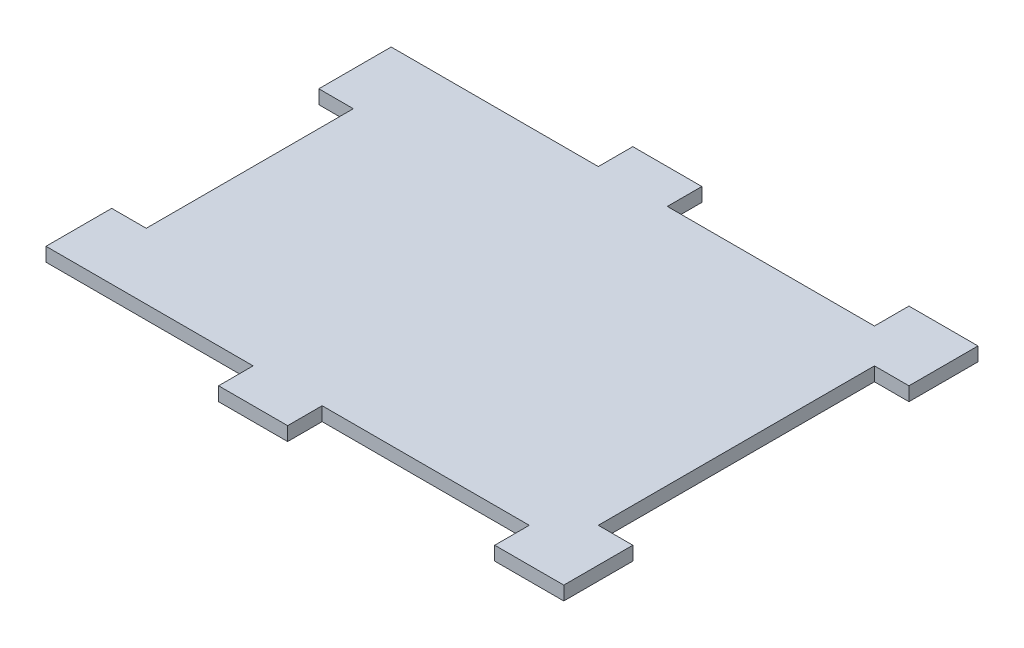
ISO-10303-21;
HEADER;
FILE_DESCRIPTION(('STEP AP214'),'2;1');
FILE_NAME('part.step','',(''),(''),'','','');
FILE_SCHEMA(('AUTOMOTIVE_DESIGN { 1 0 10303 214 1 1 1 1 }'));
ENDSEC;
DATA;
#1=APPLICATION_CONTEXT('core data for automotive mechanical design processes');
#2=APPLICATION_PROTOCOL_DEFINITION('international standard','automotive_design',2000,#1);
#3=PRODUCT_CONTEXT('',#1,'mechanical');
#4=PRODUCT('Part','Part','',(#3));
#5=PRODUCT_RELATED_PRODUCT_CATEGORY('part','',(#4));
#6=PRODUCT_DEFINITION_FORMATION('','',#4);
#7=PRODUCT_DEFINITION_CONTEXT('part definition',#1,'design');
#8=PRODUCT_DEFINITION('design','',#6,#7);
#9=PRODUCT_DEFINITION_SHAPE('','',#8);
#10=(LENGTH_UNIT() NAMED_UNIT(*) SI_UNIT(.MILLI.,.METRE.));
#11=(NAMED_UNIT(*) PLANE_ANGLE_UNIT() SI_UNIT($,.RADIAN.));
#12=(NAMED_UNIT(*) SI_UNIT($,.STERADIAN.) SOLID_ANGLE_UNIT());
#13=UNCERTAINTY_MEASURE_WITH_UNIT(LENGTH_MEASURE(1.E-05),#10,'distance_accuracy_value','');
#14=(GEOMETRIC_REPRESENTATION_CONTEXT(3) GLOBAL_UNCERTAINTY_ASSIGNED_CONTEXT((#13)) GLOBAL_UNIT_ASSIGNED_CONTEXT((#10,
#11,#12)) REPRESENTATION_CONTEXT('',''));
#15=CARTESIAN_POINT('',(0.,0.,0.));
#16=DIRECTION('',(0.,0.,1.));
#17=DIRECTION('',(1.,0.,0.));
#18=AXIS2_PLACEMENT_3D('',#15,#16,#17);
#19=CARTESIAN_POINT('',(27.885513147577,-380.101338205117,0.));
#20=DIRECTION('',(1.,0.,0.));
#21=DIRECTION('',(0.,0.,-1.));
#22=AXIS2_PLACEMENT_3D('',#19,#20,#21);
#23=PLANE('',#22);
#24=DIRECTION('',(0.,0.,1.));
#25=VECTOR('',#24,1.);
#26=CARTESIAN_POINT('',(27.885513147577,-382.641338205117,0.));
#27=LINE('',#26,#25);
#28=CARTESIAN_POINT('',(27.8855131475768,-382.641338205117,117.064580044582));
#29=VERTEX_POINT('',#28);
#30=CARTESIAN_POINT('',(27.8855131475768,-382.641338205117,123.414580044582));
#31=VERTEX_POINT('',#30);
#32=EDGE_CURVE('E226',#29,#31,#27,.T.);
#33=ORIENTED_EDGE('',*,*,#32,.F.);
#34=DIRECTION('',(0.,-1.,0.));
#35=VECTOR('',#34,1.);
#36=CARTESIAN_POINT('',(27.8855131475768,-380.101338205117,117.064580044582));
#37=LINE('',#36,#35);
#38=CARTESIAN_POINT('',(27.8855131475768,-380.101338205117,117.064580044582));
#39=VERTEX_POINT('',#38);
#40=EDGE_CURVE('E11',#39,#29,#37,.T.);
#41=ORIENTED_EDGE('',*,*,#40,.F.);
#42=DIRECTION('',(0.,0.,1.));
#43=VECTOR('',#42,1.);
#44=CARTESIAN_POINT('',(27.885513147577,-380.101338205117,0.));
#45=LINE('',#44,#43);
#46=CARTESIAN_POINT('',(27.8855131475768,-380.101338205117,123.414580044582));
#47=VERTEX_POINT('',#46);
#48=EDGE_CURVE('E290',#39,#47,#45,.T.);
#49=ORIENTED_EDGE('',*,*,#48,.T.);
#50=DIRECTION('',(0.,-1.,0.));
#51=VECTOR('',#50,1.);
#52=CARTESIAN_POINT('',(27.8855131475768,-380.101338205117,123.414580044582));
#53=LINE('',#52,#51);
#54=EDGE_CURVE('E135',#47,#31,#53,.T.);
#55=ORIENTED_EDGE('',*,*,#54,.T.);
#56=EDGE_LOOP('',(#33,#41,#49,#55));
#57=FACE_BOUND('',#56,.T.);
#58=ADVANCED_FACE('F37',(#57),#23,.T.);
#59=CARTESIAN_POINT('',(0.,-380.101338205117,117.064580044582));
#60=DIRECTION('',(0.,0.,1.));
#61=DIRECTION('',(1.,0.,0.));
#62=AXIS2_PLACEMENT_3D('',#59,#60,#61);
#63=PLANE('',#62);
#64=DIRECTION('',(-1.,0.,0.));
#65=VECTOR('',#64,1.);
#66=CARTESIAN_POINT('',(0.,-382.641338205117,117.064580044582));
#67=LINE('',#66,#65);
#68=CARTESIAN_POINT('',(65.9855131475768,-382.641338205117,117.064580044582));
#69=VERTEX_POINT('',#68);
#70=EDGE_CURVE('E229',#69,#29,#67,.T.);
#71=ORIENTED_EDGE('',*,*,#70,.F.);
#72=DIRECTION('',(0.,-1.,0.));
#73=VECTOR('',#72,1.);
#74=CARTESIAN_POINT('',(65.9855131475768,-380.101338205117,117.064580044582));
#75=LINE('',#74,#73);
#76=CARTESIAN_POINT('',(65.9855131475768,-380.101338205117,117.064580044582));
#77=VERTEX_POINT('',#76);
#78=EDGE_CURVE('E45',#77,#69,#75,.T.);
#79=ORIENTED_EDGE('',*,*,#78,.F.);
#80=DIRECTION('',(-1.,0.,0.));
#81=VECTOR('',#80,1.);
#82=CARTESIAN_POINT('',(0.,-380.101338205117,117.064580044582));
#83=LINE('',#82,#81);
#84=EDGE_CURVE('E428',#77,#39,#83,.T.);
#85=ORIENTED_EDGE('',*,*,#84,.T.);
#86=ORIENTED_EDGE('',*,*,#40,.T.);
#87=EDGE_LOOP('',(#71,#79,#85,#86));
#88=FACE_BOUND('',#87,.T.);
#89=ADVANCED_FACE('F342',(#88),#63,.T.);
#90=CARTESIAN_POINT('',(65.9855131475768,-380.101338205117,0.));
#91=DIRECTION('',(-1.,0.,0.));
#92=DIRECTION('',(0.,0.,1.));
#93=AXIS2_PLACEMENT_3D('',#90,#91,#92);
#94=PLANE('',#93);
#95=DIRECTION('',(0.,0.,-1.));
#96=VECTOR('',#95,1.);
#97=CARTESIAN_POINT('',(65.9855131475768,-382.641338205117,0.));
#98=LINE('',#97,#96);
#99=CARTESIAN_POINT('',(65.9855131475768,-382.641338205117,123.414580044582));
#100=VERTEX_POINT('',#99);
#101=EDGE_CURVE('E232',#100,#69,#98,.T.);
#102=ORIENTED_EDGE('',*,*,#101,.F.);
#103=DIRECTION('',(0.,-1.,0.));
#104=VECTOR('',#103,1.);
#105=CARTESIAN_POINT('',(65.9855131475768,-380.101338205117,123.414580044582));
#106=LINE('',#105,#104);
#107=CARTESIAN_POINT('',(65.9855131475768,-380.101338205117,123.414580044582));
#108=VERTEX_POINT('',#107);
#109=EDGE_CURVE('E331',#108,#100,#106,.T.);
#110=ORIENTED_EDGE('',*,*,#109,.F.);
#111=DIRECTION('',(0.,0.,-1.));
#112=VECTOR('',#111,1.);
#113=CARTESIAN_POINT('',(65.9855131475768,-380.101338205117,0.));
#114=LINE('',#113,#112);
#115=EDGE_CURVE('E338',#108,#77,#114,.T.);
#116=ORIENTED_EDGE('',*,*,#115,.T.);
#117=ORIENTED_EDGE('',*,*,#78,.T.);
#118=EDGE_LOOP('',(#102,#110,#116,#117));
#119=FACE_BOUND('',#118,.T.);
#120=ADVANCED_FACE('F336',(#119),#94,.T.);
#121=CARTESIAN_POINT('',(0.,-380.101338205117,123.414580044582));
#122=DIRECTION('',(0.,0.,-1.));
#123=DIRECTION('',(-1.,0.,0.));
#124=AXIS2_PLACEMENT_3D('',#121,#122,#123);
#125=PLANE('',#124);
#126=DIRECTION('',(1.,0.,0.));
#127=VECTOR('',#126,1.);
#128=CARTESIAN_POINT('',(0.,-382.641338205117,123.414580044582));
#129=LINE('',#128,#127);
#130=CARTESIAN_POINT('',(78.6855131475768,-382.641338205117,123.414580044582));
#131=VERTEX_POINT('',#130);
#132=EDGE_CURVE('E235',#100,#131,#129,.T.);
#133=ORIENTED_EDGE('',*,*,#132,.T.);
#134=DIRECTION('',(0.,-1.,0.));
#135=VECTOR('',#134,1.);
#136=CARTESIAN_POINT('',(78.6855131475768,-380.101338205117,123.414580044582));
#137=LINE('',#136,#135);
#138=CARTESIAN_POINT('',(78.6855131475768,-380.101338205117,123.414580044582));
#139=VERTEX_POINT('',#138);
#140=EDGE_CURVE('E328',#139,#131,#137,.T.);
#141=ORIENTED_EDGE('',*,*,#140,.F.);
#142=DIRECTION('',(1.,0.,0.));
#143=VECTOR('',#142,1.);
#144=CARTESIAN_POINT('',(0.,-380.101338205117,123.414580044582));
#145=LINE('',#144,#143);
#146=EDGE_CURVE('E359',#108,#139,#145,.T.);
#147=ORIENTED_EDGE('',*,*,#146,.F.);
#148=ORIENTED_EDGE('',*,*,#109,.T.);
#149=EDGE_LOOP('',(#133,#141,#147,#148));
#150=FACE_BOUND('',#149,.T.);
#151=ADVANCED_FACE('F349',(#150),#125,.F.);
#152=CARTESIAN_POINT('',(78.6855131475768,-380.101338205117,0.));
#153=DIRECTION('',(-1.,0.,0.));
#154=DIRECTION('',(0.,0.,1.));
#155=AXIS2_PLACEMENT_3D('',#152,#153,#154);
#156=PLANE('',#155);
#157=DIRECTION('',(0.,0.,-1.));
#158=VECTOR('',#157,1.);
#159=CARTESIAN_POINT('',(78.6855131475768,-382.641338205117,0.));
#160=LINE('',#159,#158);
#161=CARTESIAN_POINT('',(78.6855131475768,-382.641338205117,110.714580044582));
#162=VERTEX_POINT('',#161);
#163=EDGE_CURVE('E237',#131,#162,#160,.T.);
#164=ORIENTED_EDGE('',*,*,#163,.T.);
#165=DIRECTION('',(0.,-1.,0.));
#166=VECTOR('',#165,1.);
#167=CARTESIAN_POINT('',(78.6855131475768,-380.101338205117,110.714580044582));
#168=LINE('',#167,#166);
#169=CARTESIAN_POINT('',(78.6855131475768,-380.101338205117,110.714580044582));
#170=VERTEX_POINT('',#169);
#171=EDGE_CURVE('E326',#170,#162,#168,.T.);
#172=ORIENTED_EDGE('',*,*,#171,.F.);
#173=DIRECTION('',(0.,0.,-1.));
#174=VECTOR('',#173,1.);
#175=CARTESIAN_POINT('',(78.6855131475768,-380.101338205117,0.));
#176=LINE('',#175,#174);
#177=EDGE_CURVE('E355',#139,#170,#176,.T.);
#178=ORIENTED_EDGE('',*,*,#177,.F.);
#179=ORIENTED_EDGE('',*,*,#140,.T.);
#180=EDGE_LOOP('',(#164,#172,#178,#179));
#181=FACE_BOUND('',#180,.T.);
#182=ADVANCED_FACE('F353',(#181),#156,.F.);
#183=CARTESIAN_POINT('',(0.,-380.101338205117,110.714580044582));
#184=DIRECTION('',(0.,0.,-1.));
#185=DIRECTION('',(-1.,0.,0.));
#186=AXIS2_PLACEMENT_3D('',#183,#184,#185);
#187=PLANE('',#186);
#188=DIRECTION('',(1.,0.,0.));
#189=VECTOR('',#188,1.);
#190=CARTESIAN_POINT('',(0.,-382.641338205117,110.714580044582));
#191=LINE('',#190,#189);
#192=CARTESIAN_POINT('',(72.3355131475768,-382.641338205117,110.714580044582));
#193=VERTEX_POINT('',#192);
#194=EDGE_CURVE('E240',#193,#162,#191,.T.);
#195=ORIENTED_EDGE('',*,*,#194,.F.);
#196=DIRECTION('',(0.,-1.,0.));
#197=VECTOR('',#196,1.);
#198=CARTESIAN_POINT('',(72.3355131475768,-380.101338205117,110.714580044582));
#199=LINE('',#198,#197);
#200=CARTESIAN_POINT('',(72.3355131475768,-380.101338205117,110.714580044582));
#201=VERTEX_POINT('',#200);
#202=EDGE_CURVE('E324',#201,#193,#199,.T.);
#203=ORIENTED_EDGE('',*,*,#202,.F.);
#204=DIRECTION('',(1.,0.,0.));
#205=VECTOR('',#204,1.);
#206=CARTESIAN_POINT('',(0.,-380.101338205117,110.714580044582));
#207=LINE('',#206,#205);
#208=EDGE_CURVE('E358',#201,#170,#207,.T.);
#209=ORIENTED_EDGE('',*,*,#208,.T.);
#210=ORIENTED_EDGE('',*,*,#171,.T.);
#211=EDGE_LOOP('',(#195,#203,#209,#210));
#212=FACE_BOUND('',#211,.T.);
#213=ADVANCED_FACE('F618',(#212),#187,.T.);
#214=CARTESIAN_POINT('',(72.3355131475768,-380.101338205117,0.));
#215=DIRECTION('',(1.,0.,0.));
#216=DIRECTION('',(0.,0.,-1.));
#217=AXIS2_PLACEMENT_3D('',#214,#215,#216);
#218=PLANE('',#217);
#219=DIRECTION('',(0.,0.,1.));
#220=VECTOR('',#219,1.);
#221=CARTESIAN_POINT('',(72.3355131475768,-382.641338205117,0.));
#222=LINE('',#221,#220);
#223=CARTESIAN_POINT('',(72.3355131475768,-382.641338205117,59.9145800445821));
#224=VERTEX_POINT('',#223);
#225=EDGE_CURVE('E244',#224,#193,#222,.T.);
#226=ORIENTED_EDGE('',*,*,#225,.F.);
#227=DIRECTION('',(0.,-1.,0.));
#228=VECTOR('',#227,1.);
#229=CARTESIAN_POINT('',(72.3355131475768,-380.101338205117,59.9145800445821));
#230=LINE('',#229,#228);
#231=CARTESIAN_POINT('',(72.3355131475768,-380.101338205117,59.9145800445821));
#232=VERTEX_POINT('',#231);
#233=EDGE_CURVE('E322',#232,#224,#230,.T.);
#234=ORIENTED_EDGE('',*,*,#233,.F.);
#235=DIRECTION('',(0.,0.,1.));
#236=VECTOR('',#235,1.);
#237=CARTESIAN_POINT('',(72.3355131475768,-380.101338205117,0.));
#238=LINE('',#237,#236);
#239=EDGE_CURVE('E362',#232,#201,#238,.T.);
#240=ORIENTED_EDGE('',*,*,#239,.T.);
#241=ORIENTED_EDGE('',*,*,#202,.T.);
#242=EDGE_LOOP('',(#226,#234,#240,#241));
#243=FACE_BOUND('',#242,.T.);
#244=ADVANCED_FACE('F609',(#243),#218,.T.);
#245=CARTESIAN_POINT('',(0.,-380.101338205117,59.9145800445821));
#246=DIRECTION('',(0.,0.,1.));
#247=DIRECTION('',(1.,0.,0.));
#248=AXIS2_PLACEMENT_3D('',#245,#246,#247);
#249=PLANE('',#248);
#250=DIRECTION('',(-1.,0.,0.));
#251=VECTOR('',#250,1.);
#252=CARTESIAN_POINT('',(0.,-382.641338205117,59.9145800445821));
#253=LINE('',#252,#251);
#254=CARTESIAN_POINT('',(78.6855131475768,-382.641338205117,59.9145800445821));
#255=VERTEX_POINT('',#254);
#256=EDGE_CURVE('E247',#255,#224,#253,.T.);
#257=ORIENTED_EDGE('',*,*,#256,.F.);
#258=DIRECTION('',(0.,-1.,0.));
#259=VECTOR('',#258,1.);
#260=CARTESIAN_POINT('',(78.6855131475768,-380.101338205117,59.9145800445821));
#261=LINE('',#260,#259);
#262=CARTESIAN_POINT('',(78.6855131475768,-380.101338205117,59.9145800445821));
#263=VERTEX_POINT('',#262);
#264=EDGE_CURVE('E320',#263,#255,#261,.T.);
#265=ORIENTED_EDGE('',*,*,#264,.F.);
#266=DIRECTION('',(-1.,0.,0.));
#267=VECTOR('',#266,1.);
#268=CARTESIAN_POINT('',(0.,-380.101338205117,59.9145800445821));
#269=LINE('',#268,#267);
#270=EDGE_CURVE('E366',#263,#232,#269,.T.);
#271=ORIENTED_EDGE('',*,*,#270,.T.);
#272=ORIENTED_EDGE('',*,*,#233,.T.);
#273=EDGE_LOOP('',(#257,#265,#271,#272));
#274=FACE_BOUND('',#273,.T.);
#275=ADVANCED_FACE('F597',(#274),#249,.T.);
#276=CARTESIAN_POINT('',(78.6855131475768,-382.641338205117,47.214580044582));
#277=VERTEX_POINT('',#276);
#278=EDGE_CURVE('E241',#255,#277,#160,.T.);
#279=ORIENTED_EDGE('',*,*,#278,.T.);
#280=DIRECTION('',(0.,-1.,0.));
#281=VECTOR('',#280,1.);
#282=CARTESIAN_POINT('',(78.6855131475768,-380.101338205117,47.214580044582));
#283=LINE('',#282,#281);
#284=CARTESIAN_POINT('',(78.6855131475768,-380.101338205117,47.214580044582));
#285=VERTEX_POINT('',#284);
#286=EDGE_CURVE('E317',#285,#277,#283,.T.);
#287=ORIENTED_EDGE('',*,*,#286,.F.);
#288=EDGE_CURVE('E361',#263,#285,#176,.T.);
#289=ORIENTED_EDGE('',*,*,#288,.F.);
#290=ORIENTED_EDGE('',*,*,#264,.T.);
#291=EDGE_LOOP('',(#279,#287,#289,#290));
#292=FACE_BOUND('',#291,.T.);
#293=ADVANCED_FACE('F586',(#292),#156,.F.);
#294=CARTESIAN_POINT('',(0.,-380.101338205117,47.214580044582));
#295=DIRECTION('',(0.,0.,1.));
#296=DIRECTION('',(1.,0.,0.));
#297=AXIS2_PLACEMENT_3D('',#294,#295,#296);
#298=PLANE('',#297);
#299=DIRECTION('',(-1.,0.,0.));
#300=VECTOR('',#299,1.);
#301=CARTESIAN_POINT('',(0.,-382.641338205117,47.214580044582));
#302=LINE('',#301,#300);
#303=CARTESIAN_POINT('',(65.9855131475768,-382.641338205117,47.214580044582));
#304=VERTEX_POINT('',#303);
#305=EDGE_CURVE('E250',#277,#304,#302,.T.);
#306=ORIENTED_EDGE('',*,*,#305,.T.);
#307=DIRECTION('',(0.,-1.,0.));
#308=VECTOR('',#307,1.);
#309=CARTESIAN_POINT('',(65.9855131475768,-380.101338205117,47.214580044582));
#310=LINE('',#309,#308);
#311=CARTESIAN_POINT('',(65.9855131475768,-380.101338205117,47.214580044582));
#312=VERTEX_POINT('',#311);
#313=EDGE_CURVE('E315',#312,#304,#310,.T.);
#314=ORIENTED_EDGE('',*,*,#313,.F.);
#315=DIRECTION('',(-1.,0.,0.));
#316=VECTOR('',#315,1.);
#317=CARTESIAN_POINT('',(0.,-380.101338205117,47.214580044582));
#318=LINE('',#317,#316);
#319=EDGE_CURVE('E365',#285,#312,#318,.T.);
#320=ORIENTED_EDGE('',*,*,#319,.F.);
#321=ORIENTED_EDGE('',*,*,#286,.T.);
#322=EDGE_LOOP('',(#306,#314,#320,#321));
#323=FACE_BOUND('',#322,.T.);
#324=ADVANCED_FACE('F575',(#323),#298,.F.);
#325=CARTESIAN_POINT('',(65.9855131475768,-380.101338205117,0.));
#326=DIRECTION('',(-1.,0.,0.));
#327=DIRECTION('',(0.,0.,1.));
#328=AXIS2_PLACEMENT_3D('',#325,#326,#327);
#329=PLANE('',#328);
#330=DIRECTION('',(0.,0.,-1.));
#331=VECTOR('',#330,1.);
#332=CARTESIAN_POINT('',(65.9855131475768,-382.641338205117,0.));
#333=LINE('',#332,#331);
#334=CARTESIAN_POINT('',(65.9855131475768,-382.641338205117,53.5645800445821));
#335=VERTEX_POINT('',#334);
#336=EDGE_CURVE('E253',#335,#304,#333,.T.);
#337=ORIENTED_EDGE('',*,*,#336,.F.);
#338=DIRECTION('',(0.,-1.,0.));
#339=VECTOR('',#338,1.);
#340=CARTESIAN_POINT('',(65.9855131475768,-380.101338205117,53.5645800445821));
#341=LINE('',#340,#339);
#342=CARTESIAN_POINT('',(65.9855131475768,-380.101338205117,53.5645800445821));
#343=VERTEX_POINT('',#342);
#344=EDGE_CURVE('E313',#343,#335,#341,.T.);
#345=ORIENTED_EDGE('',*,*,#344,.F.);
#346=DIRECTION('',(0.,0.,-1.));
#347=VECTOR('',#346,1.);
#348=CARTESIAN_POINT('',(65.9855131475768,-380.101338205117,0.));
#349=LINE('',#348,#347);
#350=EDGE_CURVE('E370',#343,#312,#349,.T.);
#351=ORIENTED_EDGE('',*,*,#350,.T.);
#352=ORIENTED_EDGE('',*,*,#313,.T.);
#353=EDGE_LOOP('',(#337,#345,#351,#352));
#354=FACE_BOUND('',#353,.T.);
#355=ADVANCED_FACE('F565',(#354),#329,.T.);
#356=CARTESIAN_POINT('',(0.,-380.101338205117,53.5645800445821));
#357=DIRECTION('',(0.,0.,-1.));
#358=DIRECTION('',(-1.,0.,0.));
#359=AXIS2_PLACEMENT_3D('',#356,#357,#358);
#360=PLANE('',#359);
#361=DIRECTION('',(1.,0.,0.));
#362=VECTOR('',#361,1.);
#363=CARTESIAN_POINT('',(0.,-382.641338205117,53.5645800445821));
#364=LINE('',#363,#362);
#365=CARTESIAN_POINT('',(27.8855131475768,-382.641338205117,53.5645800445821));
#366=VERTEX_POINT('',#365);
#367=EDGE_CURVE('E256',#366,#335,#364,.T.);
#368=ORIENTED_EDGE('',*,*,#367,.F.);
#369=DIRECTION('',(0.,-1.,0.));
#370=VECTOR('',#369,1.);
#371=CARTESIAN_POINT('',(27.8855131475768,-380.101338205117,53.5645800445821));
#372=LINE('',#371,#370);
#373=CARTESIAN_POINT('',(27.8855131475768,-380.101338205117,53.5645800445821));
#374=VERTEX_POINT('',#373);
#375=EDGE_CURVE('E311',#374,#366,#372,.T.);
#376=ORIENTED_EDGE('',*,*,#375,.F.);
#377=DIRECTION('',(1.,0.,0.));
#378=VECTOR('',#377,1.);
#379=CARTESIAN_POINT('',(0.,-380.101338205117,53.5645800445821));
#380=LINE('',#379,#378);
#381=EDGE_CURVE('E380',#374,#343,#380,.T.);
#382=ORIENTED_EDGE('',*,*,#381,.T.);
#383=ORIENTED_EDGE('',*,*,#344,.T.);
#384=EDGE_LOOP('',(#368,#376,#382,#383));
#385=FACE_BOUND('',#384,.T.);
#386=ADVANCED_FACE('F554',(#385),#360,.T.);
#387=CARTESIAN_POINT('',(27.8855131475767,-380.101338205117,0.));
#388=DIRECTION('',(1.,0.,0.));
#389=DIRECTION('',(0.,0.,-1.));
#390=AXIS2_PLACEMENT_3D('',#387,#388,#389);
#391=PLANE('',#390);
#392=DIRECTION('',(0.,0.,1.));
#393=VECTOR('',#392,1.);
#394=CARTESIAN_POINT('',(27.8855131475767,-382.641338205117,0.));
#395=LINE('',#394,#393);
#396=CARTESIAN_POINT('',(27.8855131475768,-382.641338205117,47.214580044582));
#397=VERTEX_POINT('',#396);
#398=EDGE_CURVE('E259',#397,#366,#395,.T.);
#399=ORIENTED_EDGE('',*,*,#398,.F.);
#400=DIRECTION('',(0.,-1.,0.));
#401=VECTOR('',#400,1.);
#402=CARTESIAN_POINT('',(27.8855131475768,-380.101338205117,47.214580044582));
#403=LINE('',#402,#401);
#404=CARTESIAN_POINT('',(27.8855131475768,-380.101338205117,47.214580044582));
#405=VERTEX_POINT('',#404);
#406=EDGE_CURVE('E309',#405,#397,#403,.T.);
#407=ORIENTED_EDGE('',*,*,#406,.F.);
#408=DIRECTION('',(0.,0.,1.));
#409=VECTOR('',#408,1.);
#410=CARTESIAN_POINT('',(27.8855131475767,-380.101338205117,0.));
#411=LINE('',#410,#409);
#412=EDGE_CURVE('E383',#405,#374,#411,.T.);
#413=ORIENTED_EDGE('',*,*,#412,.T.);
#414=ORIENTED_EDGE('',*,*,#375,.T.);
#415=EDGE_LOOP('',(#399,#407,#413,#414));
#416=FACE_BOUND('',#415,.T.);
#417=ADVANCED_FACE('F543',(#416),#391,.T.);
#418=CARTESIAN_POINT('',(0.,-380.101338205117,47.214580044582));
#419=DIRECTION('',(0.,0.,1.));
#420=DIRECTION('',(1.,0.,0.));
#421=AXIS2_PLACEMENT_3D('',#418,#419,#420);
#422=PLANE('',#421);
#423=DIRECTION('',(-1.,0.,0.));
#424=VECTOR('',#423,1.);
#425=CARTESIAN_POINT('',(0.,-382.641338205117,47.214580044582));
#426=LINE('',#425,#424);
#427=CARTESIAN_POINT('',(15.1855131475768,-382.641338205117,47.214580044582));
#428=VERTEX_POINT('',#427);
#429=EDGE_CURVE('E262',#397,#428,#426,.T.);
#430=ORIENTED_EDGE('',*,*,#429,.T.);
#431=DIRECTION('',(0.,-1.,0.));
#432=VECTOR('',#431,1.);
#433=CARTESIAN_POINT('',(15.1855131475768,-380.101338205117,47.214580044582));
#434=LINE('',#433,#432);
#435=CARTESIAN_POINT('',(15.1855131475768,-380.101338205117,47.214580044582));
#436=VERTEX_POINT('',#435);
#437=EDGE_CURVE('E306',#436,#428,#434,.T.);
#438=ORIENTED_EDGE('',*,*,#437,.F.);
#439=DIRECTION('',(-1.,0.,0.));
#440=VECTOR('',#439,1.);
#441=CARTESIAN_POINT('',(0.,-380.101338205117,47.214580044582));
#442=LINE('',#441,#440);
#443=EDGE_CURVE('E386',#405,#436,#442,.T.);
#444=ORIENTED_EDGE('',*,*,#443,.F.);
#445=ORIENTED_EDGE('',*,*,#406,.T.);
#446=EDGE_LOOP('',(#430,#438,#444,#445));
#447=FACE_BOUND('',#446,.T.);
#448=ADVANCED_FACE('F532',(#447),#422,.F.);
#449=CARTESIAN_POINT('',(15.1855131475768,-380.101338205117,0.));
#450=DIRECTION('',(1.,0.,0.));
#451=DIRECTION('',(0.,0.,-1.));
#452=AXIS2_PLACEMENT_3D('',#449,#450,#451);
#453=PLANE('',#452);
#454=DIRECTION('',(0.,0.,1.));
#455=VECTOR('',#454,1.);
#456=CARTESIAN_POINT('',(15.1855131475768,-382.641338205117,0.));
#457=LINE('',#456,#455);
#458=CARTESIAN_POINT('',(15.1855131475768,-382.641338205117,53.5645800445821));
#459=VERTEX_POINT('',#458);
#460=EDGE_CURVE('E264',#428,#459,#457,.T.);
#461=ORIENTED_EDGE('',*,*,#460,.T.);
#462=DIRECTION('',(0.,-1.,0.));
#463=VECTOR('',#462,1.);
#464=CARTESIAN_POINT('',(15.1855131475768,-380.101338205117,53.5645800445821));
#465=LINE('',#464,#463);
#466=CARTESIAN_POINT('',(15.1855131475768,-380.101338205117,53.5645800445821));
#467=VERTEX_POINT('',#466);
#468=EDGE_CURVE('E304',#467,#459,#465,.T.);
#469=ORIENTED_EDGE('',*,*,#468,.F.);
#470=DIRECTION('',(0.,0.,1.));
#471=VECTOR('',#470,1.);
#472=CARTESIAN_POINT('',(15.1855131475768,-380.101338205117,0.));
#473=LINE('',#472,#471);
#474=EDGE_CURVE('E388',#436,#467,#473,.T.);
#475=ORIENTED_EDGE('',*,*,#474,.F.);
#476=ORIENTED_EDGE('',*,*,#437,.T.);
#477=EDGE_LOOP('',(#461,#469,#475,#476));
#478=FACE_BOUND('',#477,.T.);
#479=ADVANCED_FACE('F521',(#478),#453,.F.);
#480=CARTESIAN_POINT('',(0.,-380.101338205117,53.5645800445821));
#481=DIRECTION('',(0.,0.,-1.));
#482=DIRECTION('',(-1.,0.,0.));
#483=AXIS2_PLACEMENT_3D('',#480,#481,#482);
#484=PLANE('',#483);
#485=DIRECTION('',(1.,0.,0.));
#486=VECTOR('',#485,1.);
#487=CARTESIAN_POINT('',(0.,-382.641338205117,53.5645800445821));
#488=LINE('',#487,#486);
#489=CARTESIAN_POINT('',(-22.9144868524232,-382.641338205117,53.5645800445821));
#490=VERTEX_POINT('',#489);
#491=EDGE_CURVE('E267',#490,#459,#488,.T.);
#492=ORIENTED_EDGE('',*,*,#491,.F.);
#493=DIRECTION('',(0.,-1.,0.));
#494=VECTOR('',#493,1.);
#495=CARTESIAN_POINT('',(-22.9144868524232,-380.101338205117,53.5645800445821));
#496=LINE('',#495,#494);
#497=CARTESIAN_POINT('',(-22.9144868524232,-380.101338205117,53.5645800445821));
#498=VERTEX_POINT('',#497);
#499=EDGE_CURVE('E302',#498,#490,#496,.T.);
#500=ORIENTED_EDGE('',*,*,#499,.F.);
#501=DIRECTION('',(1.,0.,0.));
#502=VECTOR('',#501,1.);
#503=CARTESIAN_POINT('',(0.,-380.101338205117,53.5645800445821));
#504=LINE('',#503,#502);
#505=EDGE_CURVE('E390',#498,#467,#504,.T.);
#506=ORIENTED_EDGE('',*,*,#505,.T.);
#507=ORIENTED_EDGE('',*,*,#468,.T.);
#508=EDGE_LOOP('',(#492,#500,#506,#507));
#509=FACE_BOUND('',#508,.T.);
#510=ADVANCED_FACE('F510',(#509),#484,.T.);
#511=CARTESIAN_POINT('',(-22.9144868524232,-380.101338205117,0.));
#512=DIRECTION('',(1.,0.,0.));
#513=DIRECTION('',(0.,0.,-1.));
#514=AXIS2_PLACEMENT_3D('',#511,#512,#513);
#515=PLANE('',#514);
#516=DIRECTION('',(0.,0.,1.));
#517=VECTOR('',#516,1.);
#518=CARTESIAN_POINT('',(-22.9144868524232,-382.641338205117,0.));
#519=LINE('',#518,#517);
#520=CARTESIAN_POINT('',(-22.9144868524232,-382.641338205117,66.8771529199686));
#521=VERTEX_POINT('',#520);
#522=EDGE_CURVE('E270',#490,#521,#519,.T.);
#523=ORIENTED_EDGE('',*,*,#522,.T.);
#524=DIRECTION('',(0.,-1.,0.));
#525=VECTOR('',#524,1.);
#526=CARTESIAN_POINT('',(-22.9144868524232,-380.101338205117,66.8771529199686));
#527=LINE('',#526,#525);
#528=CARTESIAN_POINT('',(-22.9144868524232,-380.101338205117,66.8771529199686));
#529=VERTEX_POINT('',#528);
#530=EDGE_CURVE('E300',#529,#521,#527,.T.);
#531=ORIENTED_EDGE('',*,*,#530,.F.);
#532=DIRECTION('',(0.,0.,1.));
#533=VECTOR('',#532,1.);
#534=CARTESIAN_POINT('',(-22.9144868524232,-380.101338205117,0.));
#535=LINE('',#534,#533);
#536=EDGE_CURVE('E393',#498,#529,#535,.T.);
#537=ORIENTED_EDGE('',*,*,#536,.F.);
#538=ORIENTED_EDGE('',*,*,#499,.T.);
#539=EDGE_LOOP('',(#523,#531,#537,#538));
#540=FACE_BOUND('',#539,.T.);
#541=ADVANCED_FACE('F500',(#540),#515,.F.);
#542=CARTESIAN_POINT('',(0.,-380.101338205117,66.8771529199686));
#543=DIRECTION('',(0.,0.,1.));
#544=DIRECTION('',(1.,0.,0.));
#545=AXIS2_PLACEMENT_3D('',#542,#543,#544);
#546=PLANE('',#545);
#547=DIRECTION('',(-1.,0.,0.));
#548=VECTOR('',#547,1.);
#549=CARTESIAN_POINT('',(0.,-382.641338205117,66.8771529199686));
#550=LINE('',#549,#548);
#551=CARTESIAN_POINT('',(-16.5644868524232,-382.641338205117,66.8771529199686));
#552=VERTEX_POINT('',#551);
#553=EDGE_CURVE('E273',#552,#521,#550,.T.);
#554=ORIENTED_EDGE('',*,*,#553,.F.);
#555=DIRECTION('',(0.,-1.,0.));
#556=VECTOR('',#555,1.);
#557=CARTESIAN_POINT('',(-16.5644868524232,-380.101338205117,66.8771529199686));
#558=LINE('',#557,#556);
#559=CARTESIAN_POINT('',(-16.5644868524232,-380.101338205117,66.8771529199686));
#560=VERTEX_POINT('',#559);
#561=EDGE_CURVE('E298',#560,#552,#558,.T.);
#562=ORIENTED_EDGE('',*,*,#561,.F.);
#563=DIRECTION('',(-1.,0.,0.));
#564=VECTOR('',#563,1.);
#565=CARTESIAN_POINT('',(0.,-380.101338205117,66.8771529199686));
#566=LINE('',#565,#564);
#567=EDGE_CURVE('E395',#560,#529,#566,.T.);
#568=ORIENTED_EDGE('',*,*,#567,.T.);
#569=ORIENTED_EDGE('',*,*,#530,.T.);
#570=EDGE_LOOP('',(#554,#562,#568,#569));
#571=FACE_BOUND('',#570,.T.);
#572=ADVANCED_FACE('F491',(#571),#546,.T.);
#573=CARTESIAN_POINT('',(-16.5644868524232,-380.101338205117,0.));
#574=DIRECTION('',(-1.,0.,0.));
#575=DIRECTION('',(0.,0.,1.));
#576=AXIS2_PLACEMENT_3D('',#573,#574,#575);
#577=PLANE('',#576);
#578=DIRECTION('',(0.,0.,-1.));
#579=VECTOR('',#578,1.);
#580=CARTESIAN_POINT('',(-16.5644868524232,-382.641338205117,0.));
#581=LINE('',#580,#579);
#582=CARTESIAN_POINT('',(-16.5644868524232,-382.641338205117,104.977152919969));
#583=VERTEX_POINT('',#582);
#584=EDGE_CURVE('E276',#583,#552,#581,.T.);
#585=ORIENTED_EDGE('',*,*,#584,.F.);
#586=DIRECTION('',(0.,-1.,0.));
#587=VECTOR('',#586,1.);
#588=CARTESIAN_POINT('',(-16.5644868524232,-380.101338205117,104.977152919969));
#589=LINE('',#588,#587);
#590=CARTESIAN_POINT('',(-16.5644868524232,-380.101338205117,104.977152919969));
#591=VERTEX_POINT('',#590);
#592=EDGE_CURVE('E296',#591,#583,#589,.T.);
#593=ORIENTED_EDGE('',*,*,#592,.F.);
#594=DIRECTION('',(0.,0.,-1.));
#595=VECTOR('',#594,1.);
#596=CARTESIAN_POINT('',(-16.5644868524232,-380.101338205117,0.));
#597=LINE('',#596,#595);
#598=EDGE_CURVE('E398',#591,#560,#597,.T.);
#599=ORIENTED_EDGE('',*,*,#598,.T.);
#600=ORIENTED_EDGE('',*,*,#561,.T.);
#601=EDGE_LOOP('',(#585,#593,#599,#600));
#602=FACE_BOUND('',#601,.T.);
#603=ADVANCED_FACE('F410',(#602),#577,.T.);
#604=CARTESIAN_POINT('',(0.,-380.101338205117,104.977152919969));
#605=DIRECTION('',(0.,0.,-1.));
#606=DIRECTION('',(-1.,0.,0.));
#607=AXIS2_PLACEMENT_3D('',#604,#605,#606);
#608=PLANE('',#607);
#609=DIRECTION('',(1.,0.,0.));
#610=VECTOR('',#609,1.);
#611=CARTESIAN_POINT('',(0.,-382.641338205117,104.977152919969));
#612=LINE('',#611,#610);
#613=CARTESIAN_POINT('',(-22.9144868524232,-382.641338205117,104.977152919969));
#614=VERTEX_POINT('',#613);
#615=EDGE_CURVE('E279',#614,#583,#612,.T.);
#616=ORIENTED_EDGE('',*,*,#615,.F.);
#617=DIRECTION('',(0.,-1.,0.));
#618=VECTOR('',#617,1.);
#619=CARTESIAN_POINT('',(-22.9144868524232,-380.101338205117,104.977152919969));
#620=LINE('',#619,#618);
#621=CARTESIAN_POINT('',(-22.9144868524232,-380.101338205117,104.977152919969));
#622=VERTEX_POINT('',#621);
#623=EDGE_CURVE('E294',#622,#614,#620,.T.);
#624=ORIENTED_EDGE('',*,*,#623,.F.);
#625=DIRECTION('',(1.,0.,0.));
#626=VECTOR('',#625,1.);
#627=CARTESIAN_POINT('',(0.,-380.101338205117,104.977152919969));
#628=LINE('',#627,#626);
#629=EDGE_CURVE('E401',#622,#591,#628,.T.);
#630=ORIENTED_EDGE('',*,*,#629,.T.);
#631=ORIENTED_EDGE('',*,*,#592,.T.);
#632=EDGE_LOOP('',(#616,#624,#630,#631));
#633=FACE_BOUND('',#632,.T.);
#634=ADVANCED_FACE('F405',(#633),#608,.T.);
#635=CARTESIAN_POINT('',(-22.9144868524232,-380.101338205117,0.));
#636=DIRECTION('',(1.,0.,0.));
#637=DIRECTION('',(0.,0.,-1.));
#638=AXIS2_PLACEMENT_3D('',#635,#636,#637);
#639=PLANE('',#638);
#640=DIRECTION('',(0.,0.,1.));
#641=VECTOR('',#640,1.);
#642=CARTESIAN_POINT('',(-22.9144868524232,-382.641338205117,0.));
#643=LINE('',#642,#641);
#644=CARTESIAN_POINT('',(-22.9144868524232,-382.641338205117,117.064580044582));
#645=VERTEX_POINT('',#644);
#646=EDGE_CURVE('E282',#614,#645,#643,.T.);
#647=ORIENTED_EDGE('',*,*,#646,.T.);
#648=DIRECTION('',(0.,-1.,0.));
#649=VECTOR('',#648,1.);
#650=CARTESIAN_POINT('',(-22.9144868524232,-380.101338205117,117.064580044582));
#651=LINE('',#650,#649);
#652=CARTESIAN_POINT('',(-22.9144868524232,-380.101338205117,117.064580044582));
#653=VERTEX_POINT('',#652);
#654=EDGE_CURVE('E212',#653,#645,#651,.T.);
#655=ORIENTED_EDGE('',*,*,#654,.F.);
#656=DIRECTION('',(0.,0.,1.));
#657=VECTOR('',#656,1.);
#658=CARTESIAN_POINT('',(-22.9144868524232,-380.101338205117,0.));
#659=LINE('',#658,#657);
#660=EDGE_CURVE('E218',#622,#653,#659,.T.);
#661=ORIENTED_EDGE('',*,*,#660,.F.);
#662=ORIENTED_EDGE('',*,*,#623,.T.);
#663=EDGE_LOOP('',(#647,#655,#661,#662));
#664=FACE_BOUND('',#663,.T.);
#665=ADVANCED_FACE('F414',(#664),#639,.F.);
#666=CARTESIAN_POINT('',(0.,-380.101338205117,117.064580044582));
#667=DIRECTION('',(0.,0.,1.));
#668=DIRECTION('',(1.,0.,0.));
#669=AXIS2_PLACEMENT_3D('',#666,#667,#668);
#670=PLANE('',#669);
#671=DIRECTION('',(-1.,0.,0.));
#672=VECTOR('',#671,1.);
#673=CARTESIAN_POINT('',(0.,-382.641338205117,117.064580044582));
#674=LINE('',#673,#672);
#675=CARTESIAN_POINT('',(15.1855131475768,-382.641338205117,117.064580044582));
#676=VERTEX_POINT('',#675);
#677=EDGE_CURVE('E207',#676,#645,#674,.T.);
#678=ORIENTED_EDGE('',*,*,#677,.F.);
#679=DIRECTION('',(0.,-1.,0.));
#680=VECTOR('',#679,1.);
#681=CARTESIAN_POINT('',(15.1855131475768,-380.101338205117,117.064580044582));
#682=LINE('',#681,#680);
#683=CARTESIAN_POINT('',(15.1855131475768,-380.101338205117,117.064580044582));
#684=VERTEX_POINT('',#683);
#685=EDGE_CURVE('E202',#684,#676,#682,.T.);
#686=ORIENTED_EDGE('',*,*,#685,.F.);
#687=DIRECTION('',(-1.,0.,0.));
#688=VECTOR('',#687,1.);
#689=CARTESIAN_POINT('',(0.,-380.101338205117,117.064580044582));
#690=LINE('',#689,#688);
#691=EDGE_CURVE('E205',#684,#653,#690,.T.);
#692=ORIENTED_EDGE('',*,*,#691,.T.);
#693=ORIENTED_EDGE('',*,*,#654,.T.);
#694=EDGE_LOOP('',(#678,#686,#692,#693));
#695=FACE_BOUND('',#694,.T.);
#696=ADVANCED_FACE('F204',(#695),#670,.T.);
#697=CARTESIAN_POINT('',(15.1855131475768,-380.101338205117,0.));
#698=DIRECTION('',(-1.,0.,0.));
#699=DIRECTION('',(0.,0.,1.));
#700=AXIS2_PLACEMENT_3D('',#697,#698,#699);
#701=PLANE('',#700);
#702=DIRECTION('',(0.,0.,-1.));
#703=VECTOR('',#702,1.);
#704=CARTESIAN_POINT('',(15.1855131475768,-382.641338205117,0.));
#705=LINE('',#704,#703);
#706=CARTESIAN_POINT('',(15.1855131475768,-382.641338205117,123.414580044582));
#707=VERTEX_POINT('',#706);
#708=EDGE_CURVE('E286',#707,#676,#705,.T.);
#709=ORIENTED_EDGE('',*,*,#708,.F.);
#710=DIRECTION('',(0.,-1.,0.));
#711=VECTOR('',#710,1.);
#712=CARTESIAN_POINT('',(15.1855131475768,-380.101338205117,123.414580044582));
#713=LINE('',#712,#711);
#714=CARTESIAN_POINT('',(15.1855131475768,-380.101338205117,123.414580044582));
#715=VERTEX_POINT('',#714);
#716=EDGE_CURVE('E128',#715,#707,#713,.T.);
#717=ORIENTED_EDGE('',*,*,#716,.F.);
#718=DIRECTION('',(0.,0.,-1.));
#719=VECTOR('',#718,1.);
#720=CARTESIAN_POINT('',(15.1855131475768,-380.101338205117,0.));
#721=LINE('',#720,#719);
#722=EDGE_CURVE('E215',#715,#684,#721,.T.);
#723=ORIENTED_EDGE('',*,*,#722,.T.);
#724=ORIENTED_EDGE('',*,*,#685,.T.);
#725=EDGE_LOOP('',(#709,#717,#723,#724));
#726=FACE_BOUND('',#725,.T.);
#727=ADVANCED_FACE('F221',(#726),#701,.T.);
#728=CARTESIAN_POINT('',(0.,-380.101338205117,123.414580044582));
#729=DIRECTION('',(0.,0.,-1.));
#730=DIRECTION('',(-1.,0.,0.));
#731=AXIS2_PLACEMENT_3D('',#728,#729,#730);
#732=PLANE('',#731);
#733=DIRECTION('',(1.,0.,0.));
#734=VECTOR('',#733,1.);
#735=CARTESIAN_POINT('',(0.,-382.641338205117,123.414580044582));
#736=LINE('',#735,#734);
#737=EDGE_CURVE('E288',#707,#31,#736,.T.);
#738=ORIENTED_EDGE('',*,*,#737,.T.);
#739=ORIENTED_EDGE('',*,*,#54,.F.);
#740=DIRECTION('',(1.,0.,0.));
#741=VECTOR('',#740,1.);
#742=CARTESIAN_POINT('',(0.,-380.101338205117,123.414580044582));
#743=LINE('',#742,#741);
#744=EDGE_CURVE('E53',#715,#47,#743,.T.);
#745=ORIENTED_EDGE('',*,*,#744,.F.);
#746=ORIENTED_EDGE('',*,*,#716,.T.);
#747=EDGE_LOOP('',(#738,#739,#745,#746));
#748=FACE_BOUND('',#747,.T.);
#749=ADVANCED_FACE('F427',(#748),#732,.F.);
#750=CARTESIAN_POINT('',(0.,-380.101338205117,0.));
#751=DIRECTION('',(0.,1.,0.));
#752=DIRECTION('',(0.,0.,1.));
#753=AXIS2_PLACEMENT_3D('',#750,#751,#752);
#754=PLANE('',#753);
#755=ORIENTED_EDGE('',*,*,#48,.F.);
#756=ORIENTED_EDGE('',*,*,#84,.F.);
#757=ORIENTED_EDGE('',*,*,#115,.F.);
#758=ORIENTED_EDGE('',*,*,#146,.T.);
#759=ORIENTED_EDGE('',*,*,#177,.T.);
#760=ORIENTED_EDGE('',*,*,#208,.F.);
#761=ORIENTED_EDGE('',*,*,#239,.F.);
#762=ORIENTED_EDGE('',*,*,#270,.F.);
#763=ORIENTED_EDGE('',*,*,#288,.T.);
#764=ORIENTED_EDGE('',*,*,#319,.T.);
#765=ORIENTED_EDGE('',*,*,#350,.F.);
#766=ORIENTED_EDGE('',*,*,#381,.F.);
#767=ORIENTED_EDGE('',*,*,#412,.F.);
#768=ORIENTED_EDGE('',*,*,#443,.T.);
#769=ORIENTED_EDGE('',*,*,#474,.T.);
#770=ORIENTED_EDGE('',*,*,#505,.F.);
#771=ORIENTED_EDGE('',*,*,#536,.T.);
#772=ORIENTED_EDGE('',*,*,#567,.F.);
#773=ORIENTED_EDGE('',*,*,#598,.F.);
#774=ORIENTED_EDGE('',*,*,#629,.F.);
#775=ORIENTED_EDGE('',*,*,#660,.T.);
#776=ORIENTED_EDGE('',*,*,#691,.F.);
#777=ORIENTED_EDGE('',*,*,#722,.F.);
#778=ORIENTED_EDGE('',*,*,#744,.T.);
#779=EDGE_LOOP('',(#755,#756,#757,#758,#759,#760,#761,#762,#763,#764,#765,#766,#767,#768,#769,
#770,#771,#772,#773,#774,#775,#776,#777,#778));
#780=FACE_BOUND('',#779,.T.);
#781=ADVANCED_FACE('F214',(#780),#754,.T.);
#782=CARTESIAN_POINT('',(0.,-382.641338205117,0.));
#783=DIRECTION('',(0.,1.,0.));
#784=DIRECTION('',(0.,0.,1.));
#785=AXIS2_PLACEMENT_3D('',#782,#783,#784);
#786=PLANE('',#785);
#787=ORIENTED_EDGE('',*,*,#32,.T.);
#788=ORIENTED_EDGE('',*,*,#737,.F.);
#789=ORIENTED_EDGE('',*,*,#708,.T.);
#790=ORIENTED_EDGE('',*,*,#677,.T.);
#791=ORIENTED_EDGE('',*,*,#646,.F.);
#792=ORIENTED_EDGE('',*,*,#615,.T.);
#793=ORIENTED_EDGE('',*,*,#584,.T.);
#794=ORIENTED_EDGE('',*,*,#553,.T.);
#795=ORIENTED_EDGE('',*,*,#522,.F.);
#796=ORIENTED_EDGE('',*,*,#491,.T.);
#797=ORIENTED_EDGE('',*,*,#460,.F.);
#798=ORIENTED_EDGE('',*,*,#429,.F.);
#799=ORIENTED_EDGE('',*,*,#398,.T.);
#800=ORIENTED_EDGE('',*,*,#367,.T.);
#801=ORIENTED_EDGE('',*,*,#336,.T.);
#802=ORIENTED_EDGE('',*,*,#305,.F.);
#803=ORIENTED_EDGE('',*,*,#278,.F.);
#804=ORIENTED_EDGE('',*,*,#256,.T.);
#805=ORIENTED_EDGE('',*,*,#225,.T.);
#806=ORIENTED_EDGE('',*,*,#194,.T.);
#807=ORIENTED_EDGE('',*,*,#163,.F.);
#808=ORIENTED_EDGE('',*,*,#132,.F.);
#809=ORIENTED_EDGE('',*,*,#101,.T.);
#810=ORIENTED_EDGE('',*,*,#70,.T.);
#811=EDGE_LOOP('',(#787,#788,#789,#790,#791,#792,#793,#794,#795,#796,#797,#798,#799,#800,#801,
#802,#803,#804,#805,#806,#807,#808,#809,#810));
#812=FACE_BOUND('',#811,.T.);
#813=ADVANCED_FACE('F345',(#812),#786,.F.);
#814=CLOSED_SHELL('',(#58,#89,#120,#151,#182,#213,#244,#275,#293,#324,#355,#386,#417,#448,#479,
#510,#541,#572,#603,#634,#665,#696,#727,#749,#781,#813));
#815=MANIFOLD_SOLID_BREP('B2',#814);
#816=ADVANCED_BREP_SHAPE_REPRESENTATION('',(#18,#815),#14);
#817=SHAPE_DEFINITION_REPRESENTATION(#9,#816);
ENDSEC;
END-ISO-10303-21;
